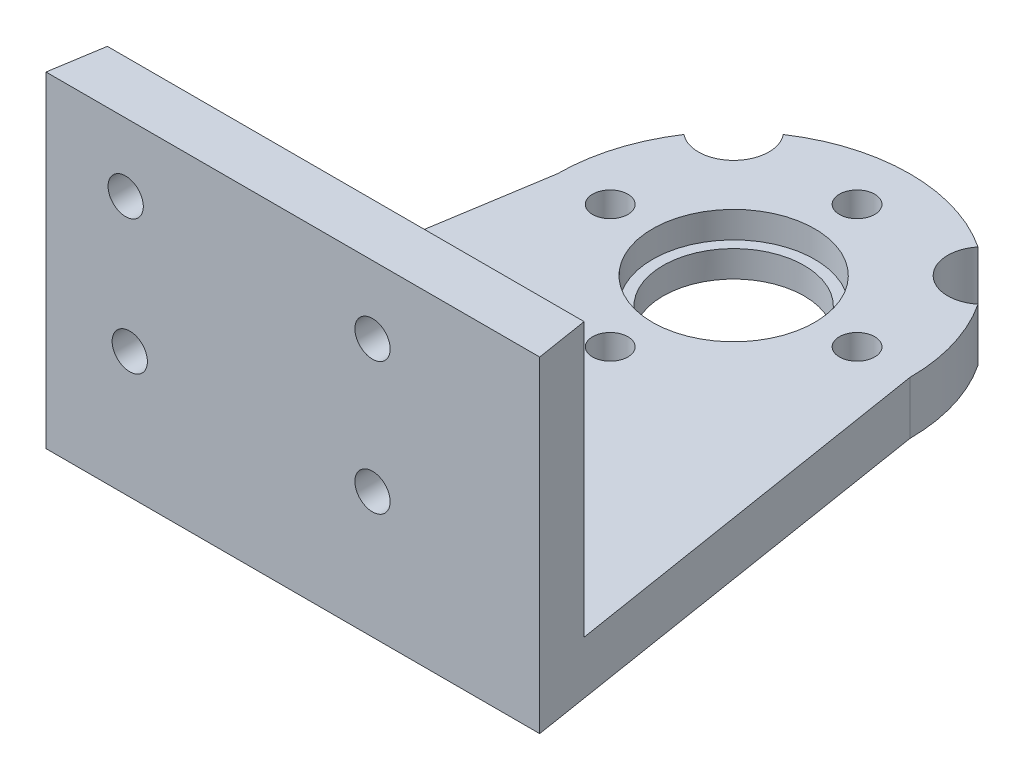
ISO-10303-21;
HEADER;
FILE_DESCRIPTION(('STEP AP214'),'2;1');
FILE_NAME('part.step','',(''),(''),'','','');
FILE_SCHEMA(('AUTOMOTIVE_DESIGN { 1 0 10303 214 1 1 1 1 }'));
ENDSEC;
DATA;
#1=APPLICATION_CONTEXT('core data for automotive mechanical design processes');
#2=APPLICATION_PROTOCOL_DEFINITION('international standard','automotive_design',2000,#1);
#3=PRODUCT_CONTEXT('',#1,'mechanical');
#4=PRODUCT('Part','Part','',(#3));
#5=PRODUCT_RELATED_PRODUCT_CATEGORY('part','',(#4));
#6=PRODUCT_DEFINITION_FORMATION('','',#4);
#7=PRODUCT_DEFINITION_CONTEXT('part definition',#1,'design');
#8=PRODUCT_DEFINITION('design','',#6,#7);
#9=PRODUCT_DEFINITION_SHAPE('','',#8);
#10=(LENGTH_UNIT() NAMED_UNIT(*) SI_UNIT(.MILLI.,.METRE.));
#11=(NAMED_UNIT(*) PLANE_ANGLE_UNIT() SI_UNIT($,.RADIAN.));
#12=(NAMED_UNIT(*) SI_UNIT($,.STERADIAN.) SOLID_ANGLE_UNIT());
#13=UNCERTAINTY_MEASURE_WITH_UNIT(LENGTH_MEASURE(1.E-05),#10,'distance_accuracy_value','');
#14=(GEOMETRIC_REPRESENTATION_CONTEXT(3) GLOBAL_UNCERTAINTY_ASSIGNED_CONTEXT((#13)) GLOBAL_UNIT_ASSIGNED_CONTEXT((#10,
#11,#12)) REPRESENTATION_CONTEXT('',''));
#15=CARTESIAN_POINT('',(0.,0.,0.));
#16=DIRECTION('',(0.,0.,1.));
#17=DIRECTION('',(1.,0.,0.));
#18=AXIS2_PLACEMENT_3D('',#15,#16,#17);
#19=CARTESIAN_POINT('',(0.,3.,0.));
#20=DIRECTION('',(0.,-1.,0.));
#21=DIRECTION('',(0.,0.,-1.));
#22=AXIS2_PLACEMENT_3D('',#19,#20,#21);
#23=CYLINDRICAL_SURFACE('',#22,10.);
#24=CARTESIAN_POINT('',(0.,0.,0.));
#25=DIRECTION('',(0.,1.,0.));
#26=DIRECTION('',(0.,0.,-1.));
#27=AXIS2_PLACEMENT_3D('',#24,#25,#26);
#28=CIRCLE('',#27,10.);
#29=CARTESIAN_POINT('',(10.,0.,0.));
#30=VERTEX_POINT('',#29);
#31=CARTESIAN_POINT('',(8.33677118357518,0.,-5.52252172768116));
#32=VERTEX_POINT('',#31);
#33=EDGE_CURVE('E221',#30,#32,#28,.T.);
#34=ORIENTED_EDGE('',*,*,#33,.T.);
#35=DIRECTION('',(0.,1.,0.));
#36=VECTOR('',#35,1.);
#37=CARTESIAN_POINT('',(8.33677118357519,-2.,-5.52252172768115));
#38=LINE('',#37,#36);
#39=CARTESIAN_POINT('',(8.33677118357519,3.,-5.52252172768115));
#40=VERTEX_POINT('',#39);
#41=EDGE_CURVE('E51',#32,#40,#38,.T.);
#42=ORIENTED_EDGE('',*,*,#41,.T.);
#43=CARTESIAN_POINT('',(0.,3.,0.));
#44=DIRECTION('',(0.,1.,0.));
#45=DIRECTION('',(0.,0.,-1.));
#46=AXIS2_PLACEMENT_3D('',#43,#44,#45);
#47=CIRCLE('',#46,10.);
#48=CARTESIAN_POINT('',(10.,3.,0.));
#49=VERTEX_POINT('',#48);
#50=EDGE_CURVE('E125',#49,#40,#47,.T.);
#51=ORIENTED_EDGE('',*,*,#50,.F.);
#52=DIRECTION('',(0.,-1.,0.));
#53=VECTOR('',#52,1.);
#54=CARTESIAN_POINT('',(10.,3.,0.));
#55=LINE('',#54,#53);
#56=EDGE_CURVE('E149',#49,#30,#55,.T.);
#57=ORIENTED_EDGE('',*,*,#56,.T.);
#58=EDGE_LOOP('',(#34,#42,#51,#57));
#59=FACE_BOUND('',#58,.T.);
#60=ADVANCED_FACE('F37',(#59),#23,.T.);
#61=CARTESIAN_POINT('',(5.52252172768112,3.,-8.33677118357521));
#62=VERTEX_POINT('',#61);
#63=CARTESIAN_POINT('',(-5.52252172768112,3.,-8.33677118357521));
#64=VERTEX_POINT('',#63);
#65=EDGE_CURVE('E122',#62,#64,#47,.T.);
#66=ORIENTED_EDGE('',*,*,#65,.F.);
#67=DIRECTION('',(0.,1.,0.));
#68=VECTOR('',#67,1.);
#69=CARTESIAN_POINT('',(5.52252172768112,-2.,-8.33677118357521));
#70=LINE('',#69,#68);
#71=CARTESIAN_POINT('',(5.52252172768113,0.,-8.3367711835752));
#72=VERTEX_POINT('',#71);
#73=EDGE_CURVE('E112',#62,#72,#70,.F.);
#74=ORIENTED_EDGE('',*,*,#73,.T.);
#75=CARTESIAN_POINT('',(-5.52252172768113,0.,-8.3367711835752));
#76=VERTEX_POINT('',#75);
#77=EDGE_CURVE('E59',#72,#76,#28,.T.);
#78=ORIENTED_EDGE('',*,*,#77,.T.);
#79=DIRECTION('',(0.,1.,0.));
#80=VECTOR('',#79,1.);
#81=CARTESIAN_POINT('',(-5.52252172768112,-2.,-8.33677118357521));
#82=LINE('',#81,#80);
#83=EDGE_CURVE('E129',#76,#64,#82,.T.);
#84=ORIENTED_EDGE('',*,*,#83,.T.);
#85=EDGE_LOOP('',(#66,#74,#78,#84));
#86=FACE_BOUND('',#85,.T.);
#87=ADVANCED_FACE('F128',(#86),#23,.T.);
#88=CARTESIAN_POINT('',(0.,-10.,0.));
#89=DIRECTION('',(0.,1.,0.));
#90=DIRECTION('',(0.,0.,1.));
#91=AXIS2_PLACEMENT_3D('',#88,#89,#90);
#92=CYLINDRICAL_SURFACE('',#91,4.);
#93=CARTESIAN_POINT('',(0.,0.,0.));
#94=DIRECTION('',(0.,-1.,0.));
#95=DIRECTION('',(0.,0.,-1.));
#96=AXIS2_PLACEMENT_3D('',#93,#94,#95);
#97=CIRCLE('',#96,4.);
#98=CARTESIAN_POINT('',(0.,0.,-4.));
#99=VERTEX_POINT('',#98);
#100=EDGE_CURVE('E217',#99,#99,#97,.T.);
#101=ORIENTED_EDGE('',*,*,#100,.T.);
#102=EDGE_LOOP('',(#101));
#103=FACE_BOUND('',#102,.T.);
#104=CARTESIAN_POINT('',(0.,1.5,0.));
#105=DIRECTION('',(0.,1.,0.));
#106=DIRECTION('',(0.,0.,1.));
#107=AXIS2_PLACEMENT_3D('',#104,#105,#106);
#108=CIRCLE('',#107,4.);
#109=CARTESIAN_POINT('',(0.,1.5,4.));
#110=VERTEX_POINT('',#109);
#111=EDGE_CURVE('E155',#110,#110,#108,.F.);
#112=ORIENTED_EDGE('',*,*,#111,.F.);
#113=EDGE_LOOP('',(#112));
#114=FACE_BOUND('',#113,.T.);
#115=ADVANCED_FACE('F352',(#103,#114),#92,.F.);
#116=CARTESIAN_POINT('',(0.,3.,0.));
#117=DIRECTION('',(0.,-1.,0.));
#118=DIRECTION('',(0.,0.,-1.));
#119=AXIS2_PLACEMENT_3D('',#116,#117,#118);
#120=PLANE('',#119);
#121=CARTESIAN_POINT('',(0.,3.,0.));
#122=DIRECTION('',(0.,1.,0.));
#123=DIRECTION('',(0.,0.,1.));
#124=AXIS2_PLACEMENT_3D('',#121,#122,#123);
#125=CIRCLE('',#124,4.6);
#126=CARTESIAN_POINT('',(0.,3.,4.6));
#127=VERTEX_POINT('',#126);
#128=EDGE_CURVE('E276',#127,#127,#125,.T.);
#129=ORIENTED_EDGE('',*,*,#128,.F.);
#130=EDGE_LOOP('',(#129));
#131=FACE_BOUND('',#130,.T.);
#132=CARTESIAN_POINT('',(-6.52,3.,19.));
#133=DIRECTION('',(0.,1.,0.));
#134=DIRECTION('',(0.,0.,1.));
#135=AXIS2_PLACEMENT_3D('',#132,#133,#134);
#136=CIRCLE('',#135,1.);
#137=CARTESIAN_POINT('',(-6.52,3.,20.));
#138=VERTEX_POINT('',#137);
#139=EDGE_CURVE('E136',#138,#138,#136,.T.);
#140=ORIENTED_EDGE('',*,*,#139,.F.);
#141=EDGE_LOOP('',(#140));
#142=FACE_BOUND('',#141,.T.);
#143=CARTESIAN_POINT('',(6.52,3.,19.));
#144=DIRECTION('',(0.,1.,0.));
#145=DIRECTION('',(0.,0.,-1.));
#146=AXIS2_PLACEMENT_3D('',#143,#144,#145);
#147=CIRCLE('',#146,1.);
#148=CARTESIAN_POINT('',(6.52,3.,18.));
#149=VERTEX_POINT('',#148);
#150=EDGE_CURVE('E190',#149,#149,#147,.T.);
#151=ORIENTED_EDGE('',*,*,#150,.F.);
#152=EDGE_LOOP('',(#151));
#153=FACE_BOUND('',#152,.T.);
#154=CARTESIAN_POINT('',(0.,3.,19.));
#155=DIRECTION('',(0.,1.,0.));
#156=DIRECTION('',(0.,0.,1.));
#157=AXIS2_PLACEMENT_3D('',#154,#155,#156);
#158=CIRCLE('',#157,1.);
#159=CARTESIAN_POINT('',(0.,3.,20.));
#160=VERTEX_POINT('',#159);
#161=EDGE_CURVE('E186',#160,#160,#158,.T.);
#162=ORIENTED_EDGE('',*,*,#161,.F.);
#163=EDGE_LOOP('',(#162));
#164=FACE_BOUND('',#163,.T.);
#165=CARTESIAN_POINT('',(0.,3.,7.));
#166=DIRECTION('',(0.,1.,0.));
#167=DIRECTION('',(0.,0.,1.));
#168=AXIS2_PLACEMENT_3D('',#165,#166,#167);
#169=CIRCLE('',#168,1.);
#170=CARTESIAN_POINT('',(0.,3.,8.));
#171=VERTEX_POINT('',#170);
#172=EDGE_CURVE('E180',#171,#171,#169,.T.);
#173=ORIENTED_EDGE('',*,*,#172,.F.);
#174=EDGE_LOOP('',(#173));
#175=FACE_BOUND('',#174,.T.);
#176=CARTESIAN_POINT('',(-7.,3.,0.));
#177=DIRECTION('',(0.,1.,0.));
#178=DIRECTION('',(0.,0.,1.));
#179=AXIS2_PLACEMENT_3D('',#176,#177,#178);
#180=CIRCLE('',#179,1.);
#181=CARTESIAN_POINT('',(-7.,3.,0.999999999999975));
#182=VERTEX_POINT('',#181);
#183=EDGE_CURVE('E174',#182,#182,#180,.T.);
#184=ORIENTED_EDGE('',*,*,#183,.F.);
#185=EDGE_LOOP('',(#184));
#186=FACE_BOUND('',#185,.T.);
#187=CARTESIAN_POINT('',(0.,3.,-7.));
#188=DIRECTION('',(0.,1.,0.));
#189=DIRECTION('',(0.,0.,1.));
#190=AXIS2_PLACEMENT_3D('',#187,#188,#189);
#191=CIRCLE('',#190,1.);
#192=CARTESIAN_POINT('',(0.,3.,-6.));
#193=VERTEX_POINT('',#192);
#194=EDGE_CURVE('E166',#193,#193,#191,.T.);
#195=ORIENTED_EDGE('',*,*,#194,.F.);
#196=EDGE_LOOP('',(#195));
#197=FACE_BOUND('',#196,.T.);
#198=CARTESIAN_POINT('',(7.,3.,0.));
#199=DIRECTION('',(0.,1.,0.));
#200=DIRECTION('',(0.,0.,1.));
#201=AXIS2_PLACEMENT_3D('',#198,#199,#200);
#202=CIRCLE('',#201,1.);
#203=CARTESIAN_POINT('',(7.,3.,1.00000000000007));
#204=VERTEX_POINT('',#203);
#205=EDGE_CURVE('E167',#204,#204,#202,.T.);
#206=ORIENTED_EDGE('',*,*,#205,.F.);
#207=EDGE_LOOP('',(#206));
#208=FACE_BOUND('',#207,.T.);
#209=ORIENTED_EDGE('',*,*,#50,.T.);
#210=CARTESIAN_POINT('',(7.07106781186546,3.,-7.07106781186549));
#211=DIRECTION('',(0.,1.,0.));
#212=DIRECTION('',(0.,0.,-1.));
#213=AXIS2_PLACEMENT_3D('',#210,#211,#212);
#214=CIRCLE('',#213,2.);
#215=EDGE_CURVE('E115',#62,#40,#214,.T.);
#216=ORIENTED_EDGE('',*,*,#215,.F.);
#217=ORIENTED_EDGE('',*,*,#65,.T.);
#218=CARTESIAN_POINT('',(-7.07106781186546,3.,-7.07106781186549));
#219=DIRECTION('',(0.,1.,0.));
#220=DIRECTION('',(0.,0.,1.));
#221=AXIS2_PLACEMENT_3D('',#218,#219,#220);
#222=CIRCLE('',#221,2.);
#223=CARTESIAN_POINT('',(-8.33677118357519,3.,-5.52252172768115));
#224=VERTEX_POINT('',#223);
#225=EDGE_CURVE('E284',#224,#64,#222,.T.);
#226=ORIENTED_EDGE('',*,*,#225,.F.);
#227=CARTESIAN_POINT('',(-10.,3.,0.));
#228=VERTEX_POINT('',#227);
#229=EDGE_CURVE('E130',#224,#228,#47,.T.);
#230=ORIENTED_EDGE('',*,*,#229,.T.);
#231=DIRECTION('',(-0.157990501106673,0.,0.987440631916705));
#232=VECTOR('',#231,1.);
#233=CARTESIAN_POINT('',(-10.,3.,0.));
#234=LINE('',#233,#232);
#235=CARTESIAN_POINT('',(-13.52,3.,22.));
#236=VERTEX_POINT('',#235);
#237=EDGE_CURVE('E132',#228,#236,#234,.T.);
#238=ORIENTED_EDGE('',*,*,#237,.T.);
#239=DIRECTION('',(-1.,0.,0.));
#240=VECTOR('',#239,1.);
#241=CARTESIAN_POINT('',(-13.52,3.,22.));
#242=LINE('',#241,#240);
#243=CARTESIAN_POINT('',(13.52,3.,22.));
#244=VERTEX_POINT('',#243);
#245=EDGE_CURVE('E150',#244,#236,#242,.T.);
#246=ORIENTED_EDGE('',*,*,#245,.F.);
#247=DIRECTION('',(-0.157990501106673,0.,-0.987440631916705));
#248=VECTOR('',#247,1.);
#249=CARTESIAN_POINT('',(10.,3.,0.));
#250=LINE('',#249,#248);
#251=EDGE_CURVE('E145',#244,#49,#250,.T.);
#252=ORIENTED_EDGE('',*,*,#251,.T.);
#253=EDGE_LOOP('',(#209,#216,#217,#226,#230,#238,#246,#252));
#254=FACE_BOUND('',#253,.T.);
#255=ADVANCED_FACE('F120',(#131,#142,#153,#164,#175,#186,#197,#208,#254),#120,.F.);
#256=ORIENTED_EDGE('',*,*,#229,.F.);
#257=DIRECTION('',(0.,1.,0.));
#258=VECTOR('',#257,1.);
#259=CARTESIAN_POINT('',(-8.33677118357519,-2.,-5.52252172768115));
#260=LINE('',#259,#258);
#261=CARTESIAN_POINT('',(-8.33677118357518,0.,-5.52252172768116));
#262=VERTEX_POINT('',#261);
#263=EDGE_CURVE('E282',#224,#262,#260,.F.);
#264=ORIENTED_EDGE('',*,*,#263,.T.);
#265=CARTESIAN_POINT('',(-10.,0.,0.));
#266=VERTEX_POINT('',#265);
#267=EDGE_CURVE('E219',#262,#266,#28,.T.);
#268=ORIENTED_EDGE('',*,*,#267,.T.);
#269=DIRECTION('',(0.,-1.,0.));
#270=VECTOR('',#269,1.);
#271=CARTESIAN_POINT('',(-10.,3.,0.));
#272=LINE('',#271,#270);
#273=EDGE_CURVE('E224',#228,#266,#272,.T.);
#274=ORIENTED_EDGE('',*,*,#273,.F.);
#275=EDGE_LOOP('',(#256,#264,#268,#274));
#276=FACE_BOUND('',#275,.T.);
#277=ADVANCED_FACE('F39',(#276),#23,.T.);
#278=CARTESIAN_POINT('',(-10.,3.,0.));
#279=DIRECTION('',(0.987440631916705,0.,0.157990501106673));
#280=DIRECTION('',(0.157990501106673,0.,-0.987440631916705));
#281=AXIS2_PLACEMENT_3D('',#278,#279,#280);
#282=PLANE('',#281);
#283=DIRECTION('',(-0.157990501106673,0.,0.987440631916705));
#284=VECTOR('',#283,1.);
#285=CARTESIAN_POINT('',(-10.,0.,0.));
#286=LINE('',#285,#284);
#287=CARTESIAN_POINT('',(-14.,0.,25.));
#288=VERTEX_POINT('',#287);
#289=EDGE_CURVE('E238',#266,#288,#286,.T.);
#290=ORIENTED_EDGE('',*,*,#289,.T.);
#291=DIRECTION('',(0.,-1.,0.));
#292=VECTOR('',#291,1.);
#293=CARTESIAN_POINT('',(-14.,3.,25.));
#294=LINE('',#293,#292);
#295=CARTESIAN_POINT('',(-14.,18.5,25.));
#296=VERTEX_POINT('',#295);
#297=EDGE_CURVE('E227',#296,#288,#294,.T.);
#298=ORIENTED_EDGE('',*,*,#297,.F.);
#299=DIRECTION('',(-0.157990501106673,0.,0.987440631916705));
#300=VECTOR('',#299,1.);
#301=CARTESIAN_POINT('',(-13.52,18.5,22.));
#302=LINE('',#301,#300);
#303=CARTESIAN_POINT('',(-13.52,18.5,22.));
#304=VERTEX_POINT('',#303);
#305=EDGE_CURVE('E154',#304,#296,#302,.T.);
#306=ORIENTED_EDGE('',*,*,#305,.F.);
#307=DIRECTION('',(0.,-1.,0.));
#308=VECTOR('',#307,1.);
#309=CARTESIAN_POINT('',(-13.52,18.5,22.));
#310=LINE('',#309,#308);
#311=EDGE_CURVE('E156',#304,#236,#310,.T.);
#312=ORIENTED_EDGE('',*,*,#311,.T.);
#313=ORIENTED_EDGE('',*,*,#237,.F.);
#314=ORIENTED_EDGE('',*,*,#273,.T.);
#315=EDGE_LOOP('',(#290,#298,#306,#312,#313,#314));
#316=FACE_BOUND('',#315,.T.);
#317=ADVANCED_FACE('F330',(#316),#282,.F.);
#318=CARTESIAN_POINT('',(-14.,3.,25.));
#319=DIRECTION('',(0.,0.,-1.));
#320=DIRECTION('',(-1.,0.,0.));
#321=AXIS2_PLACEMENT_3D('',#318,#319,#320);
#322=PLANE('',#321);
#323=CARTESIAN_POINT('',(-9.24883244468018,7.15183711810761,25.));
#324=DIRECTION('',(0.,0.,-1.));
#325=DIRECTION('',(-1.,0.,0.));
#326=AXIS2_PLACEMENT_3D('',#323,#324,#325);
#327=CIRCLE('',#326,1.);
#328=CARTESIAN_POINT('',(-10.2488324446802,7.15183711810761,25.));
#329=VERTEX_POINT('',#328);
#330=EDGE_CURVE('E304',#329,#329,#327,.T.);
#331=ORIENTED_EDGE('',*,*,#330,.T.);
#332=EDGE_LOOP('',(#331));
#333=FACE_BOUND('',#332,.T.);
#334=CARTESIAN_POINT('',(-9.48122486494631,14.6518371181076,25.));
#335=DIRECTION('',(0.,0.,-1.));
#336=DIRECTION('',(-1.,0.,0.));
#337=AXIS2_PLACEMENT_3D('',#334,#335,#336);
#338=CIRCLE('',#337,1.);
#339=CARTESIAN_POINT('',(-10.4812248649463,14.6518371181076,25.));
#340=VERTEX_POINT('',#339);
#341=EDGE_CURVE('E298',#340,#340,#338,.T.);
#342=ORIENTED_EDGE('',*,*,#341,.T.);
#343=EDGE_LOOP('',(#342));
#344=FACE_BOUND('',#343,.T.);
#345=CARTESIAN_POINT('',(4.5187751350537,14.6518371181076,25.));
#346=DIRECTION('',(0.,0.,-1.));
#347=DIRECTION('',(-1.,0.,0.));
#348=AXIS2_PLACEMENT_3D('',#345,#346,#347);
#349=CIRCLE('',#348,1.00000000000001);
#350=CARTESIAN_POINT('',(3.51877513505369,14.6518371181076,25.));
#351=VERTEX_POINT('',#350);
#352=EDGE_CURVE('E292',#351,#351,#349,.T.);
#353=ORIENTED_EDGE('',*,*,#352,.T.);
#354=EDGE_LOOP('',(#353));
#355=FACE_BOUND('',#354,.T.);
#356=CARTESIAN_POINT('',(4.5187751350537,7.15183711810764,25.));
#357=DIRECTION('',(0.,0.,-1.));
#358=DIRECTION('',(-1.,0.,0.));
#359=AXIS2_PLACEMENT_3D('',#356,#357,#358);
#360=CIRCLE('',#359,1.00000000000001);
#361=CARTESIAN_POINT('',(3.5187751350537,7.15183711810764,25.));
#362=VERTEX_POINT('',#361);
#363=EDGE_CURVE('E126',#362,#362,#360,.T.);
#364=ORIENTED_EDGE('',*,*,#363,.T.);
#365=EDGE_LOOP('',(#364));
#366=FACE_BOUND('',#365,.T.);
#367=DIRECTION('',(1.,0.,0.));
#368=VECTOR('',#367,1.);
#369=CARTESIAN_POINT('',(-14.,0.,25.));
#370=LINE('',#369,#368);
#371=CARTESIAN_POINT('',(14.,0.,25.));
#372=VERTEX_POINT('',#371);
#373=EDGE_CURVE('E236',#288,#372,#370,.T.);
#374=ORIENTED_EDGE('',*,*,#373,.T.);
#375=DIRECTION('',(0.,-1.,0.));
#376=VECTOR('',#375,1.);
#377=CARTESIAN_POINT('',(14.,3.,25.));
#378=LINE('',#377,#376);
#379=CARTESIAN_POINT('',(14.,18.5,25.));
#380=VERTEX_POINT('',#379);
#381=EDGE_CURVE('E230',#380,#372,#378,.T.);
#382=ORIENTED_EDGE('',*,*,#381,.F.);
#383=DIRECTION('',(1.,0.,0.));
#384=VECTOR('',#383,1.);
#385=CARTESIAN_POINT('',(-14.,18.5,25.));
#386=LINE('',#385,#384);
#387=EDGE_CURVE('E270',#296,#380,#386,.T.);
#388=ORIENTED_EDGE('',*,*,#387,.F.);
#389=ORIENTED_EDGE('',*,*,#297,.T.);
#390=EDGE_LOOP('',(#374,#382,#388,#389));
#391=FACE_BOUND('',#390,.T.);
#392=ADVANCED_FACE('F329',(#333,#344,#355,#366,#391),#322,.F.);
#393=CARTESIAN_POINT('',(10.,3.,0.));
#394=DIRECTION('',(-0.987440631916705,0.,0.157990501106673));
#395=DIRECTION('',(0.157990501106673,0.,0.987440631916705));
#396=AXIS2_PLACEMENT_3D('',#393,#394,#395);
#397=PLANE('',#396);
#398=DIRECTION('',(-0.157990501106673,0.,-0.987440631916705));
#399=VECTOR('',#398,1.);
#400=CARTESIAN_POINT('',(10.,0.,0.));
#401=LINE('',#400,#399);
#402=EDGE_CURVE('E133',#372,#30,#401,.T.);
#403=ORIENTED_EDGE('',*,*,#402,.T.);
#404=ORIENTED_EDGE('',*,*,#56,.F.);
#405=ORIENTED_EDGE('',*,*,#251,.F.);
#406=DIRECTION('',(0.,-1.,0.));
#407=VECTOR('',#406,1.);
#408=CARTESIAN_POINT('',(13.52,18.5,22.));
#409=LINE('',#408,#407);
#410=CARTESIAN_POINT('',(13.52,18.5,22.));
#411=VERTEX_POINT('',#410);
#412=EDGE_CURVE('E170',#411,#244,#409,.T.);
#413=ORIENTED_EDGE('',*,*,#412,.F.);
#414=DIRECTION('',(-0.157990501106673,0.,-0.987440631916705));
#415=VECTOR('',#414,1.);
#416=CARTESIAN_POINT('',(14.,18.5,25.));
#417=LINE('',#416,#415);
#418=EDGE_CURVE('E267',#380,#411,#417,.T.);
#419=ORIENTED_EDGE('',*,*,#418,.F.);
#420=ORIENTED_EDGE('',*,*,#381,.T.);
#421=EDGE_LOOP('',(#403,#404,#405,#413,#419,#420));
#422=FACE_BOUND('',#421,.T.);
#423=ADVANCED_FACE('F206',(#422),#397,.F.);
#424=CARTESIAN_POINT('',(0.,0.,0.));
#425=DIRECTION('',(0.,-1.,0.));
#426=DIRECTION('',(0.,0.,-1.));
#427=AXIS2_PLACEMENT_3D('',#424,#425,#426);
#428=PLANE('',#427);
#429=CARTESIAN_POINT('',(7.07106781186546,0.,-7.07106781186549));
#430=DIRECTION('',(0.,-1.,0.));
#431=DIRECTION('',(0.,0.,-1.));
#432=AXIS2_PLACEMENT_3D('',#429,#430,#431);
#433=CIRCLE('',#432,2.);
#434=EDGE_CURVE('E11',#32,#72,#433,.T.);
#435=ORIENTED_EDGE('',*,*,#434,.F.);
#436=ORIENTED_EDGE('',*,*,#33,.F.);
#437=ORIENTED_EDGE('',*,*,#402,.F.);
#438=ORIENTED_EDGE('',*,*,#373,.F.);
#439=ORIENTED_EDGE('',*,*,#289,.F.);
#440=ORIENTED_EDGE('',*,*,#267,.F.);
#441=CARTESIAN_POINT('',(-7.07106781186546,0.,-7.07106781186549));
#442=DIRECTION('',(0.,-1.,0.));
#443=DIRECTION('',(0.,0.,-1.));
#444=AXIS2_PLACEMENT_3D('',#441,#442,#443);
#445=CIRCLE('',#444,2.);
#446=EDGE_CURVE('E45',#76,#262,#445,.T.);
#447=ORIENTED_EDGE('',*,*,#446,.F.);
#448=ORIENTED_EDGE('',*,*,#77,.F.);
#449=EDGE_LOOP('',(#435,#436,#437,#438,#439,#440,#447,#448));
#450=FACE_BOUND('',#449,.T.);
#451=CARTESIAN_POINT('',(7.,0.,0.));
#452=DIRECTION('',(0.,1.,0.));
#453=DIRECTION('',(0.,0.,1.));
#454=AXIS2_PLACEMENT_3D('',#451,#452,#453);
#455=CIRCLE('',#454,1.);
#456=CARTESIAN_POINT('',(7.,0.,1.00000000000007));
#457=VERTEX_POINT('',#456);
#458=EDGE_CURVE('E163',#457,#457,#455,.T.);
#459=ORIENTED_EDGE('',*,*,#458,.T.);
#460=EDGE_LOOP('',(#459));
#461=FACE_BOUND('',#460,.T.);
#462=CARTESIAN_POINT('',(0.,0.,-7.));
#463=DIRECTION('',(0.,1.,0.));
#464=DIRECTION('',(0.,0.,1.));
#465=AXIS2_PLACEMENT_3D('',#462,#463,#464);
#466=CIRCLE('',#465,1.);
#467=CARTESIAN_POINT('',(0.,0.,-6.));
#468=VERTEX_POINT('',#467);
#469=EDGE_CURVE('E171',#468,#468,#466,.T.);
#470=ORIENTED_EDGE('',*,*,#469,.T.);
#471=EDGE_LOOP('',(#470));
#472=FACE_BOUND('',#471,.T.);
#473=CARTESIAN_POINT('',(-7.,0.,0.));
#474=DIRECTION('',(0.,1.,0.));
#475=DIRECTION('',(0.,0.,1.));
#476=AXIS2_PLACEMENT_3D('',#473,#474,#475);
#477=CIRCLE('',#476,1.);
#478=CARTESIAN_POINT('',(-7.,0.,0.999999999999975));
#479=VERTEX_POINT('',#478);
#480=EDGE_CURVE('E177',#479,#479,#477,.T.);
#481=ORIENTED_EDGE('',*,*,#480,.T.);
#482=EDGE_LOOP('',(#481));
#483=FACE_BOUND('',#482,.T.);
#484=CARTESIAN_POINT('',(0.,0.,7.));
#485=DIRECTION('',(0.,1.,0.));
#486=DIRECTION('',(0.,0.,1.));
#487=AXIS2_PLACEMENT_3D('',#484,#485,#486);
#488=CIRCLE('',#487,1.);
#489=CARTESIAN_POINT('',(0.,0.,8.));
#490=VERTEX_POINT('',#489);
#491=EDGE_CURVE('E183',#490,#490,#488,.T.);
#492=ORIENTED_EDGE('',*,*,#491,.T.);
#493=EDGE_LOOP('',(#492));
#494=FACE_BOUND('',#493,.T.);
#495=CARTESIAN_POINT('',(0.,0.,19.));
#496=DIRECTION('',(0.,-1.,0.));
#497=DIRECTION('',(0.,0.,-1.));
#498=AXIS2_PLACEMENT_3D('',#495,#496,#497);
#499=CIRCLE('',#498,1.);
#500=CARTESIAN_POINT('',(0.,0.,18.));
#501=VERTEX_POINT('',#500);
#502=EDGE_CURVE('E146',#501,#501,#499,.T.);
#503=ORIENTED_EDGE('',*,*,#502,.F.);
#504=EDGE_LOOP('',(#503));
#505=FACE_BOUND('',#504,.T.);
#506=CARTESIAN_POINT('',(6.52,0.,19.));
#507=DIRECTION('',(0.,-1.,0.));
#508=DIRECTION('',(0.,0.,-1.));
#509=AXIS2_PLACEMENT_3D('',#506,#507,#508);
#510=CIRCLE('',#509,1.);
#511=CARTESIAN_POINT('',(6.52,0.,18.));
#512=VERTEX_POINT('',#511);
#513=EDGE_CURVE('E192',#512,#512,#510,.T.);
#514=ORIENTED_EDGE('',*,*,#513,.F.);
#515=EDGE_LOOP('',(#514));
#516=FACE_BOUND('',#515,.T.);
#517=CARTESIAN_POINT('',(-6.52,0.,19.));
#518=DIRECTION('',(0.,-1.,0.));
#519=DIRECTION('',(0.,0.,-1.));
#520=AXIS2_PLACEMENT_3D('',#517,#518,#519);
#521=CIRCLE('',#520,1.);
#522=CARTESIAN_POINT('',(-6.52,0.,18.));
#523=VERTEX_POINT('',#522);
#524=EDGE_CURVE('E214',#523,#523,#521,.T.);
#525=ORIENTED_EDGE('',*,*,#524,.F.);
#526=EDGE_LOOP('',(#525));
#527=FACE_BOUND('',#526,.T.);
#528=ORIENTED_EDGE('',*,*,#100,.F.);
#529=EDGE_LOOP('',(#528));
#530=FACE_BOUND('',#529,.T.);
#531=ADVANCED_FACE('F202',(#450,#461,#472,#483,#494,#505,#516,#527,#530),#428,.T.);
#532=CARTESIAN_POINT('',(-6.52,-10.,19.));
#533=DIRECTION('',(0.,1.,0.));
#534=DIRECTION('',(0.,0.,1.));
#535=AXIS2_PLACEMENT_3D('',#532,#533,#534);
#536=CYLINDRICAL_SURFACE('',#535,1.);
#537=ORIENTED_EDGE('',*,*,#524,.T.);
#538=EDGE_LOOP('',(#537));
#539=FACE_BOUND('',#538,.T.);
#540=ORIENTED_EDGE('',*,*,#139,.T.);
#541=EDGE_LOOP('',(#540));
#542=FACE_BOUND('',#541,.T.);
#543=ADVANCED_FACE('F205',(#539,#542),#536,.F.);
#544=CARTESIAN_POINT('',(6.52,-10.,19.));
#545=DIRECTION('',(0.,1.,0.));
#546=DIRECTION('',(0.,0.,1.));
#547=AXIS2_PLACEMENT_3D('',#544,#545,#546);
#548=CYLINDRICAL_SURFACE('',#547,1.);
#549=ORIENTED_EDGE('',*,*,#513,.T.);
#550=EDGE_LOOP('',(#549));
#551=FACE_BOUND('',#550,.T.);
#552=ORIENTED_EDGE('',*,*,#150,.T.);
#553=EDGE_LOOP('',(#552));
#554=FACE_BOUND('',#553,.T.);
#555=ADVANCED_FACE('F548',(#551,#554),#548,.F.);
#556=CARTESIAN_POINT('',(0.,-10.,19.));
#557=DIRECTION('',(0.,1.,0.));
#558=DIRECTION('',(0.,0.,1.));
#559=AXIS2_PLACEMENT_3D('',#556,#557,#558);
#560=CYLINDRICAL_SURFACE('',#559,1.);
#561=ORIENTED_EDGE('',*,*,#502,.T.);
#562=EDGE_LOOP('',(#561));
#563=FACE_BOUND('',#562,.T.);
#564=ORIENTED_EDGE('',*,*,#161,.T.);
#565=EDGE_LOOP('',(#564));
#566=FACE_BOUND('',#565,.T.);
#567=ADVANCED_FACE('F199',(#563,#566),#560,.F.);
#568=CARTESIAN_POINT('',(0.,0.,7.));
#569=DIRECTION('',(0.,1.,0.));
#570=DIRECTION('',(0.,0.,1.));
#571=AXIS2_PLACEMENT_3D('',#568,#569,#570);
#572=CYLINDRICAL_SURFACE('',#571,1.);
#573=ORIENTED_EDGE('',*,*,#491,.F.);
#574=EDGE_LOOP('',(#573));
#575=FACE_BOUND('',#574,.T.);
#576=ORIENTED_EDGE('',*,*,#172,.T.);
#577=EDGE_LOOP('',(#576));
#578=FACE_BOUND('',#577,.T.);
#579=ADVANCED_FACE('F529',(#575,#578),#572,.F.);
#580=CARTESIAN_POINT('',(-7.,0.,0.));
#581=DIRECTION('',(0.,1.,0.));
#582=DIRECTION('',(0.,0.,1.));
#583=AXIS2_PLACEMENT_3D('',#580,#581,#582);
#584=CYLINDRICAL_SURFACE('',#583,1.);
#585=ORIENTED_EDGE('',*,*,#480,.F.);
#586=EDGE_LOOP('',(#585));
#587=FACE_BOUND('',#586,.T.);
#588=ORIENTED_EDGE('',*,*,#183,.T.);
#589=EDGE_LOOP('',(#588));
#590=FACE_BOUND('',#589,.T.);
#591=ADVANCED_FACE('F519',(#587,#590),#584,.F.);
#592=CARTESIAN_POINT('',(0.,0.,-7.));
#593=DIRECTION('',(0.,1.,0.));
#594=DIRECTION('',(0.,0.,1.));
#595=AXIS2_PLACEMENT_3D('',#592,#593,#594);
#596=CYLINDRICAL_SURFACE('',#595,1.);
#597=ORIENTED_EDGE('',*,*,#469,.F.);
#598=EDGE_LOOP('',(#597));
#599=FACE_BOUND('',#598,.T.);
#600=ORIENTED_EDGE('',*,*,#194,.T.);
#601=EDGE_LOOP('',(#600));
#602=FACE_BOUND('',#601,.T.);
#603=ADVANCED_FACE('F509',(#599,#602),#596,.F.);
#604=CARTESIAN_POINT('',(7.,0.,0.));
#605=DIRECTION('',(0.,1.,0.));
#606=DIRECTION('',(0.,0.,1.));
#607=AXIS2_PLACEMENT_3D('',#604,#605,#606);
#608=CYLINDRICAL_SURFACE('',#607,1.);
#609=ORIENTED_EDGE('',*,*,#458,.F.);
#610=EDGE_LOOP('',(#609));
#611=FACE_BOUND('',#610,.T.);
#612=ORIENTED_EDGE('',*,*,#205,.T.);
#613=EDGE_LOOP('',(#612));
#614=FACE_BOUND('',#613,.T.);
#615=ADVANCED_FACE('F318',(#611,#614),#608,.F.);
#616=CARTESIAN_POINT('',(-13.52,18.5,22.));
#617=DIRECTION('',(0.,0.,1.));
#618=DIRECTION('',(1.,0.,0.));
#619=AXIS2_PLACEMENT_3D('',#616,#617,#618);
#620=PLANE('',#619);
#621=CARTESIAN_POINT('',(-9.24883244468018,7.15183711810761,22.));
#622=DIRECTION('',(0.,0.,-1.));
#623=DIRECTION('',(-1.,0.,0.));
#624=AXIS2_PLACEMENT_3D('',#621,#622,#623);
#625=CIRCLE('',#624,1.);
#626=CARTESIAN_POINT('',(-10.2488324446802,7.15183711810761,22.));
#627=VERTEX_POINT('',#626);
#628=EDGE_CURVE('E307',#627,#627,#625,.T.);
#629=ORIENTED_EDGE('',*,*,#628,.F.);
#630=EDGE_LOOP('',(#629));
#631=FACE_BOUND('',#630,.T.);
#632=CARTESIAN_POINT('',(-9.48122486494631,14.6518371181076,22.));
#633=DIRECTION('',(0.,0.,-1.));
#634=DIRECTION('',(-1.,0.,0.));
#635=AXIS2_PLACEMENT_3D('',#632,#633,#634);
#636=CIRCLE('',#635,1.);
#637=CARTESIAN_POINT('',(-10.4812248649463,14.6518371181076,22.));
#638=VERTEX_POINT('',#637);
#639=EDGE_CURVE('E301',#638,#638,#636,.T.);
#640=ORIENTED_EDGE('',*,*,#639,.F.);
#641=EDGE_LOOP('',(#640));
#642=FACE_BOUND('',#641,.T.);
#643=CARTESIAN_POINT('',(4.5187751350537,14.6518371181076,22.));
#644=DIRECTION('',(0.,0.,-1.));
#645=DIRECTION('',(-1.,0.,0.));
#646=AXIS2_PLACEMENT_3D('',#643,#644,#645);
#647=CIRCLE('',#646,1.00000000000001);
#648=CARTESIAN_POINT('',(3.51877513505369,14.6518371181076,22.));
#649=VERTEX_POINT('',#648);
#650=EDGE_CURVE('E295',#649,#649,#647,.T.);
#651=ORIENTED_EDGE('',*,*,#650,.F.);
#652=EDGE_LOOP('',(#651));
#653=FACE_BOUND('',#652,.T.);
#654=CARTESIAN_POINT('',(4.5187751350537,7.15183711810764,22.));
#655=DIRECTION('',(0.,0.,-1.));
#656=DIRECTION('',(-1.,0.,0.));
#657=AXIS2_PLACEMENT_3D('',#654,#655,#656);
#658=CIRCLE('',#657,1.00000000000001);
#659=CARTESIAN_POINT('',(3.5187751350537,7.15183711810764,22.));
#660=VERTEX_POINT('',#659);
#661=EDGE_CURVE('E289',#660,#660,#658,.T.);
#662=ORIENTED_EDGE('',*,*,#661,.F.);
#663=EDGE_LOOP('',(#662));
#664=FACE_BOUND('',#663,.T.);
#665=ORIENTED_EDGE('',*,*,#245,.T.);
#666=ORIENTED_EDGE('',*,*,#311,.F.);
#667=DIRECTION('',(-1.,0.,0.));
#668=VECTOR('',#667,1.);
#669=CARTESIAN_POINT('',(-13.52,18.5,22.));
#670=LINE('',#669,#668);
#671=EDGE_CURVE('E161',#411,#304,#670,.T.);
#672=ORIENTED_EDGE('',*,*,#671,.F.);
#673=ORIENTED_EDGE('',*,*,#412,.T.);
#674=EDGE_LOOP('',(#665,#666,#672,#673));
#675=FACE_BOUND('',#674,.T.);
#676=ADVANCED_FACE('F314',(#631,#642,#653,#664,#675),#620,.F.);
#677=CARTESIAN_POINT('',(0.,18.5,0.));
#678=DIRECTION('',(0.,1.,0.));
#679=DIRECTION('',(0.,0.,1.));
#680=AXIS2_PLACEMENT_3D('',#677,#678,#679);
#681=PLANE('',#680);
#682=ORIENTED_EDGE('',*,*,#305,.T.);
#683=ORIENTED_EDGE('',*,*,#387,.T.);
#684=ORIENTED_EDGE('',*,*,#418,.T.);
#685=ORIENTED_EDGE('',*,*,#671,.T.);
#686=EDGE_LOOP('',(#682,#683,#684,#685));
#687=FACE_BOUND('',#686,.T.);
#688=ADVANCED_FACE('F317',(#687),#681,.T.);
#689=CARTESIAN_POINT('',(0.,1.5,0.));
#690=DIRECTION('',(0.,1.,0.));
#691=DIRECTION('',(0.,0.,1.));
#692=AXIS2_PLACEMENT_3D('',#689,#690,#691);
#693=PLANE('',#692);
#694=CARTESIAN_POINT('',(0.,1.5,0.));
#695=DIRECTION('',(0.,1.,0.));
#696=DIRECTION('',(0.,0.,1.));
#697=AXIS2_PLACEMENT_3D('',#694,#695,#696);
#698=CIRCLE('',#697,4.6);
#699=CARTESIAN_POINT('',(0.,1.5,4.6));
#700=VERTEX_POINT('',#699);
#701=EDGE_CURVE('E254',#700,#700,#698,.T.);
#702=ORIENTED_EDGE('',*,*,#701,.T.);
#703=EDGE_LOOP('',(#702));
#704=FACE_BOUND('',#703,.T.);
#705=ORIENTED_EDGE('',*,*,#111,.T.);
#706=EDGE_LOOP('',(#705));
#707=FACE_BOUND('',#706,.T.);
#708=ADVANCED_FACE('F344',(#704,#707),#693,.T.);
#709=CARTESIAN_POINT('',(0.,1.5,0.));
#710=DIRECTION('',(0.,1.,0.));
#711=DIRECTION('',(0.,0.,1.));
#712=AXIS2_PLACEMENT_3D('',#709,#710,#711);
#713=CYLINDRICAL_SURFACE('',#712,4.6);
#714=ORIENTED_EDGE('',*,*,#701,.F.);
#715=EDGE_LOOP('',(#714));
#716=FACE_BOUND('',#715,.T.);
#717=ORIENTED_EDGE('',*,*,#128,.T.);
#718=EDGE_LOOP('',(#717));
#719=FACE_BOUND('',#718,.T.);
#720=ADVANCED_FACE('F336',(#716,#719),#713,.F.);
#721=CARTESIAN_POINT('',(-7.07106781186546,-7.,-7.07106781186549));
#722=DIRECTION('',(0.,1.,0.));
#723=DIRECTION('',(0.,0.,1.));
#724=AXIS2_PLACEMENT_3D('',#721,#722,#723);
#725=CYLINDRICAL_SURFACE('',#724,2.);
#726=ORIENTED_EDGE('',*,*,#446,.T.);
#727=ORIENTED_EDGE('',*,*,#263,.F.);
#728=ORIENTED_EDGE('',*,*,#225,.T.);
#729=ORIENTED_EDGE('',*,*,#83,.F.);
#730=EDGE_LOOP('',(#726,#727,#728,#729));
#731=FACE_BOUND('',#730,.T.);
#732=ADVANCED_FACE('F334',(#731),#725,.F.);
#733=CARTESIAN_POINT('',(7.07106781186546,-7.,-7.07106781186549));
#734=DIRECTION('',(0.,1.,0.));
#735=DIRECTION('',(0.,0.,1.));
#736=AXIS2_PLACEMENT_3D('',#733,#734,#735);
#737=CYLINDRICAL_SURFACE('',#736,2.);
#738=ORIENTED_EDGE('',*,*,#434,.T.);
#739=ORIENTED_EDGE('',*,*,#73,.F.);
#740=ORIENTED_EDGE('',*,*,#215,.T.);
#741=ORIENTED_EDGE('',*,*,#41,.F.);
#742=EDGE_LOOP('',(#738,#739,#740,#741));
#743=FACE_BOUND('',#742,.T.);
#744=ADVANCED_FACE('F114',(#743),#737,.F.);
#745=CARTESIAN_POINT('',(4.5187751350537,7.15183711810764,32.));
#746=DIRECTION('',(0.,0.,-1.));
#747=DIRECTION('',(-1.,0.,0.));
#748=AXIS2_PLACEMENT_3D('',#745,#746,#747);
#749=CYLINDRICAL_SURFACE('',#748,1.00000000000001);
#750=ORIENTED_EDGE('',*,*,#661,.T.);
#751=EDGE_LOOP('',(#750));
#752=FACE_BOUND('',#751,.T.);
#753=ORIENTED_EDGE('',*,*,#363,.F.);
#754=EDGE_LOOP('',(#753));
#755=FACE_BOUND('',#754,.T.);
#756=ADVANCED_FACE('F342',(#752,#755),#749,.F.);
#757=CARTESIAN_POINT('',(4.5187751350537,14.6518371181076,32.));
#758=DIRECTION('',(0.,0.,-1.));
#759=DIRECTION('',(-1.,0.,0.));
#760=AXIS2_PLACEMENT_3D('',#757,#758,#759);
#761=CYLINDRICAL_SURFACE('',#760,1.00000000000001);
#762=ORIENTED_EDGE('',*,*,#650,.T.);
#763=EDGE_LOOP('',(#762));
#764=FACE_BOUND('',#763,.T.);
#765=ORIENTED_EDGE('',*,*,#352,.F.);
#766=EDGE_LOOP('',(#765));
#767=FACE_BOUND('',#766,.T.);
#768=ADVANCED_FACE('F383',(#764,#767),#761,.F.);
#769=CARTESIAN_POINT('',(-9.48122486494631,14.6518371181076,32.));
#770=DIRECTION('',(0.,0.,-1.));
#771=DIRECTION('',(-1.,0.,0.));
#772=AXIS2_PLACEMENT_3D('',#769,#770,#771);
#773=CYLINDRICAL_SURFACE('',#772,1.);
#774=ORIENTED_EDGE('',*,*,#639,.T.);
#775=EDGE_LOOP('',(#774));
#776=FACE_BOUND('',#775,.T.);
#777=ORIENTED_EDGE('',*,*,#341,.F.);
#778=EDGE_LOOP('',(#777));
#779=FACE_BOUND('',#778,.T.);
#780=ADVANCED_FACE('F389',(#776,#779),#773,.F.);
#781=CARTESIAN_POINT('',(-9.24883244468018,7.15183711810761,32.));
#782=DIRECTION('',(0.,0.,-1.));
#783=DIRECTION('',(-1.,0.,0.));
#784=AXIS2_PLACEMENT_3D('',#781,#782,#783);
#785=CYLINDRICAL_SURFACE('',#784,1.);
#786=ORIENTED_EDGE('',*,*,#628,.T.);
#787=EDGE_LOOP('',(#786));
#788=FACE_BOUND('',#787,.T.);
#789=ORIENTED_EDGE('',*,*,#330,.F.);
#790=EDGE_LOOP('',(#789));
#791=FACE_BOUND('',#790,.T.);
#792=ADVANCED_FACE('F311',(#788,#791),#785,.F.);
#793=CLOSED_SHELL('',(#60,#87,#115,#255,#277,#317,#392,#423,#531,#543,#555,#567,#579,#591,#603,
#615,#676,#688,#708,#720,#732,#744,#756,#768,#780,#792));
#794=MANIFOLD_SOLID_BREP('B2',#793);
#795=ADVANCED_BREP_SHAPE_REPRESENTATION('',(#18,#794),#14);
#796=SHAPE_DEFINITION_REPRESENTATION(#9,#795);
ENDSEC;
END-ISO-10303-21;
